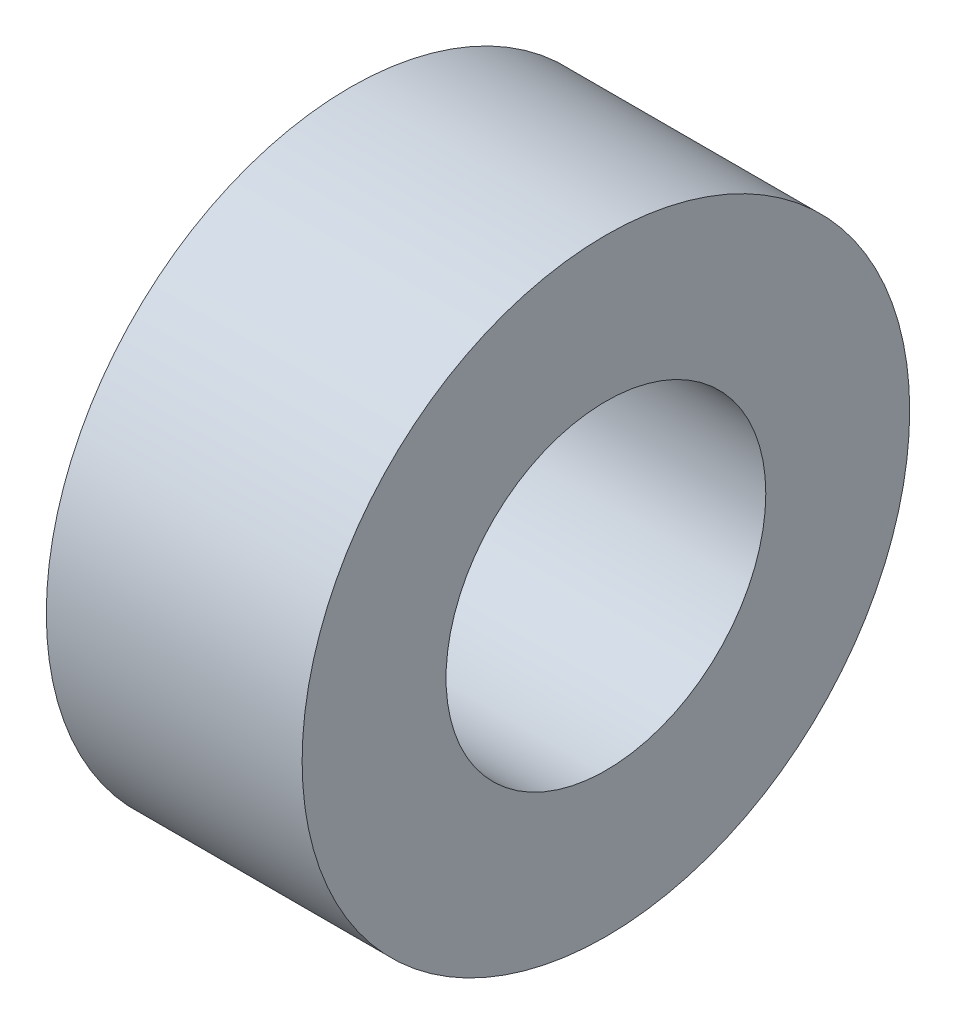
ISO-10303-21;
HEADER;
FILE_DESCRIPTION(('STEP AP214'),'2;1');
FILE_NAME('part.step','',(''),(''),'','','');
FILE_SCHEMA(('AUTOMOTIVE_DESIGN { 1 0 10303 214 1 1 1 1 }'));
ENDSEC;
DATA;
#1=APPLICATION_CONTEXT('core data for automotive mechanical design processes');
#2=APPLICATION_PROTOCOL_DEFINITION('international standard','automotive_design',2000,#1);
#3=PRODUCT_CONTEXT('',#1,'mechanical');
#4=PRODUCT('Part','Part','',(#3));
#5=PRODUCT_RELATED_PRODUCT_CATEGORY('part','',(#4));
#6=PRODUCT_DEFINITION_FORMATION('','',#4);
#7=PRODUCT_DEFINITION_CONTEXT('part definition',#1,'design');
#8=PRODUCT_DEFINITION('design','',#6,#7);
#9=PRODUCT_DEFINITION_SHAPE('','',#8);
#10=(LENGTH_UNIT() NAMED_UNIT(*) SI_UNIT(.MILLI.,.METRE.));
#11=(NAMED_UNIT(*) PLANE_ANGLE_UNIT() SI_UNIT($,.RADIAN.));
#12=(NAMED_UNIT(*) SI_UNIT($,.STERADIAN.) SOLID_ANGLE_UNIT());
#13=UNCERTAINTY_MEASURE_WITH_UNIT(LENGTH_MEASURE(1.E-05),#10,'distance_accuracy_value','');
#14=(GEOMETRIC_REPRESENTATION_CONTEXT(3) GLOBAL_UNCERTAINTY_ASSIGNED_CONTEXT((#13)) GLOBAL_UNIT_ASSIGNED_CONTEXT((#10,
#11,#12)) REPRESENTATION_CONTEXT('',''));
#15=CARTESIAN_POINT('',(0.,0.,0.));
#16=DIRECTION('',(0.,0.,1.));
#17=DIRECTION('',(1.,0.,0.));
#18=AXIS2_PLACEMENT_3D('',#15,#16,#17);
#19=CARTESIAN_POINT('',(8.,0.,0.));
#20=DIRECTION('',(1.,0.,0.));
#21=DIRECTION('',(0.,0.,-1.));
#22=AXIS2_PLACEMENT_3D('',#19,#20,#21);
#23=PLANE('',#22);
#24=CARTESIAN_POINT('',(8.,0.,0.));
#25=DIRECTION('',(1.,0.,0.));
#26=DIRECTION('',(0.,0.,-1.));
#27=AXIS2_PLACEMENT_3D('',#24,#25,#26);
#28=CIRCLE('',#27,9.5);
#29=CARTESIAN_POINT('',(8.,0.,-9.5));
#30=VERTEX_POINT('',#29);
#31=EDGE_CURVE('E10',#30,#30,#28,.T.);
#32=ORIENTED_EDGE('',*,*,#31,.T.);
#33=EDGE_LOOP('',(#32));
#34=FACE_BOUND('',#33,.T.);
#35=CARTESIAN_POINT('',(8.,0.,0.));
#36=DIRECTION('',(1.,0.,0.));
#37=DIRECTION('',(0.,0.,-1.));
#38=AXIS2_PLACEMENT_3D('',#35,#36,#37);
#39=CIRCLE('',#38,5.);
#40=CARTESIAN_POINT('',(8.,0.,-5.));
#41=VERTEX_POINT('',#40);
#42=EDGE_CURVE('E44',#41,#41,#39,.T.);
#43=ORIENTED_EDGE('',*,*,#42,.F.);
#44=EDGE_LOOP('',(#43));
#45=FACE_BOUND('',#44,.T.);
#46=ADVANCED_FACE('F33',(#34,#45),#23,.T.);
#47=CARTESIAN_POINT('',(0.,0.,0.));
#48=DIRECTION('',(1.,0.,0.));
#49=DIRECTION('',(0.,0.,-1.));
#50=AXIS2_PLACEMENT_3D('',#47,#48,#49);
#51=PLANE('',#50);
#52=CARTESIAN_POINT('',(0.,0.,0.));
#53=DIRECTION('',(1.,0.,0.));
#54=DIRECTION('',(0.,0.,-1.));
#55=AXIS2_PLACEMENT_3D('',#52,#53,#54);
#56=CIRCLE('',#55,9.5);
#57=CARTESIAN_POINT('',(0.,0.,-9.5));
#58=VERTEX_POINT('',#57);
#59=EDGE_CURVE('E37',#58,#58,#56,.T.);
#60=ORIENTED_EDGE('',*,*,#59,.F.);
#61=EDGE_LOOP('',(#60));
#62=FACE_BOUND('',#61,.T.);
#63=CARTESIAN_POINT('',(0.,0.,0.));
#64=DIRECTION('',(1.,0.,0.));
#65=DIRECTION('',(0.,0.,-1.));
#66=AXIS2_PLACEMENT_3D('',#63,#64,#65);
#67=CIRCLE('',#66,5.);
#68=CARTESIAN_POINT('',(0.,0.,-5.));
#69=VERTEX_POINT('',#68);
#70=EDGE_CURVE('E46',#69,#69,#67,.T.);
#71=ORIENTED_EDGE('',*,*,#70,.T.);
#72=EDGE_LOOP('',(#71));
#73=FACE_BOUND('',#72,.T.);
#74=ADVANCED_FACE('F56',(#62,#73),#51,.F.);
#75=CARTESIAN_POINT('',(8.,0.,0.));
#76=DIRECTION('',(-1.,0.,0.));
#77=DIRECTION('',(0.,0.,1.));
#78=AXIS2_PLACEMENT_3D('',#75,#76,#77);
#79=CYLINDRICAL_SURFACE('',#78,9.5);
#80=ORIENTED_EDGE('',*,*,#31,.F.);
#81=EDGE_LOOP('',(#80));
#82=FACE_BOUND('',#81,.T.);
#83=ORIENTED_EDGE('',*,*,#59,.T.);
#84=EDGE_LOOP('',(#83));
#85=FACE_BOUND('',#84,.T.);
#86=ADVANCED_FACE('F35',(#82,#85),#79,.T.);
#87=CARTESIAN_POINT('',(8.,0.,0.));
#88=DIRECTION('',(-1.,0.,0.));
#89=DIRECTION('',(0.,0.,1.));
#90=AXIS2_PLACEMENT_3D('',#87,#88,#89);
#91=CYLINDRICAL_SURFACE('',#90,5.);
#92=ORIENTED_EDGE('',*,*,#42,.T.);
#93=EDGE_LOOP('',(#92));
#94=FACE_BOUND('',#93,.T.);
#95=ORIENTED_EDGE('',*,*,#70,.F.);
#96=EDGE_LOOP('',(#95));
#97=FACE_BOUND('',#96,.T.);
#98=ADVANCED_FACE('F52',(#94,#97),#91,.F.);
#99=CLOSED_SHELL('',(#46,#74,#86,#98));
#100=MANIFOLD_SOLID_BREP('B2',#99);
#101=ADVANCED_BREP_SHAPE_REPRESENTATION('',(#18,#100),#14);
#102=SHAPE_DEFINITION_REPRESENTATION(#9,#101);
ENDSEC;
END-ISO-10303-21;
